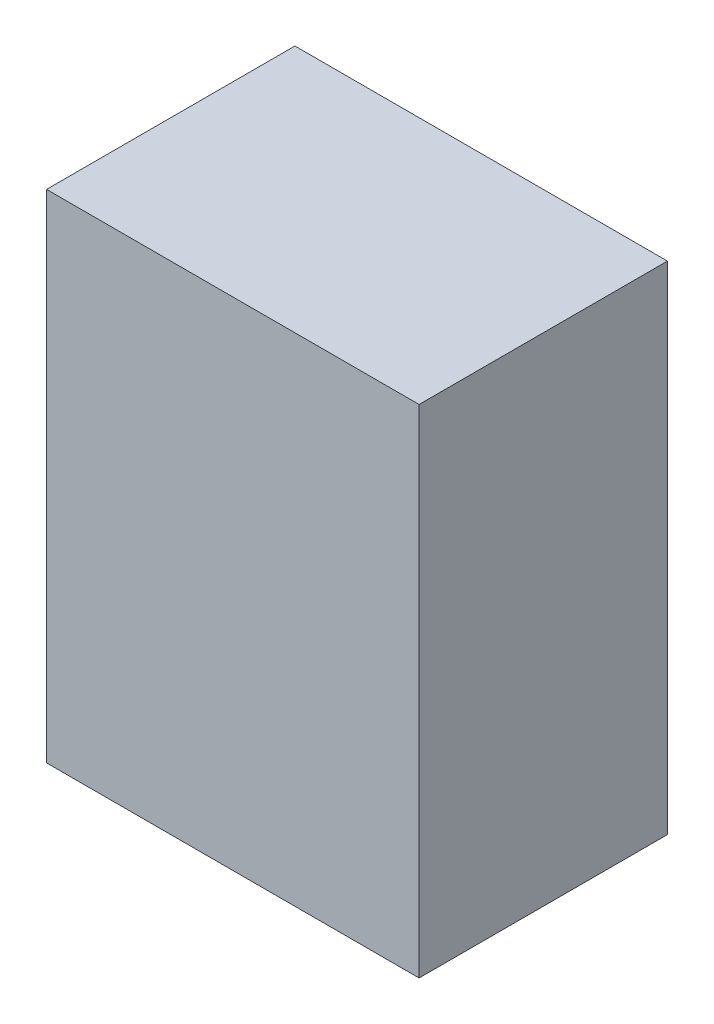
ISO-10303-21;
HEADER;
FILE_DESCRIPTION(('STEP AP214'),'2;1');
FILE_NAME('part.step','',(''),(''),'','','');
FILE_SCHEMA(('AUTOMOTIVE_DESIGN { 1 0 10303 214 1 1 1 1 }'));
ENDSEC;
DATA;
#1=APPLICATION_CONTEXT('core data for automotive mechanical design processes');
#2=APPLICATION_PROTOCOL_DEFINITION('international standard','automotive_design',2000,#1);
#3=PRODUCT_CONTEXT('',#1,'mechanical');
#4=PRODUCT('Part','Part','',(#3));
#5=PRODUCT_RELATED_PRODUCT_CATEGORY('part','',(#4));
#6=PRODUCT_DEFINITION_FORMATION('','',#4);
#7=PRODUCT_DEFINITION_CONTEXT('part definition',#1,'design');
#8=PRODUCT_DEFINITION('design','',#6,#7);
#9=PRODUCT_DEFINITION_SHAPE('','',#8);
#10=(LENGTH_UNIT() NAMED_UNIT(*) SI_UNIT(.MILLI.,.METRE.));
#11=(NAMED_UNIT(*) PLANE_ANGLE_UNIT() SI_UNIT($,.RADIAN.));
#12=(NAMED_UNIT(*) SI_UNIT($,.STERADIAN.) SOLID_ANGLE_UNIT());
#13=UNCERTAINTY_MEASURE_WITH_UNIT(LENGTH_MEASURE(1.E-05),#10,'distance_accuracy_value','');
#14=(GEOMETRIC_REPRESENTATION_CONTEXT(3) GLOBAL_UNCERTAINTY_ASSIGNED_CONTEXT((#13)) GLOBAL_UNIT_ASSIGNED_CONTEXT((#10,
#11,#12)) REPRESENTATION_CONTEXT('',''));
#15=CARTESIAN_POINT('',(0.,0.,0.));
#16=DIRECTION('',(0.,0.,1.));
#17=DIRECTION('',(1.,0.,0.));
#18=AXIS2_PLACEMENT_3D('',#15,#16,#17);
#19=CARTESIAN_POINT('',(2.38124999999999,6.35,-1.58750000000001));
#20=DIRECTION('',(-1.,0.,0.));
#21=DIRECTION('',(0.,0.,1.));
#22=AXIS2_PLACEMENT_3D('',#19,#20,#21);
#23=PLANE('',#22);
#24=DIRECTION('',(0.,0.,-1.));
#25=VECTOR('',#24,1.);
#26=CARTESIAN_POINT('',(2.38124999999999,0.,-1.58750000000001));
#27=LINE('',#26,#25);
#28=CARTESIAN_POINT('',(2.38124999999999,0.,1.58750000000001));
#29=VERTEX_POINT('',#28);
#30=CARTESIAN_POINT('',(2.38124999999999,0.,-1.58750000000001));
#31=VERTEX_POINT('',#30);
#32=EDGE_CURVE('E110',#29,#31,#27,.T.);
#33=ORIENTED_EDGE('',*,*,#32,.T.);
#34=DIRECTION('',(0.,-1.,0.));
#35=VECTOR('',#34,1.);
#36=CARTESIAN_POINT('',(2.38124999999999,6.35,-1.58750000000001));
#37=LINE('',#36,#35);
#38=CARTESIAN_POINT('',(2.38124999999999,6.35,-1.58750000000001));
#39=VERTEX_POINT('',#38);
#40=EDGE_CURVE('E11',#39,#31,#37,.T.);
#41=ORIENTED_EDGE('',*,*,#40,.F.);
#42=DIRECTION('',(0.,0.,-1.));
#43=VECTOR('',#42,1.);
#44=CARTESIAN_POINT('',(2.38124999999999,6.35,-1.58750000000001));
#45=LINE('',#44,#43);
#46=CARTESIAN_POINT('',(2.38124999999999,6.35,1.58750000000001));
#47=VERTEX_POINT('',#46);
#48=EDGE_CURVE('E92',#47,#39,#45,.T.);
#49=ORIENTED_EDGE('',*,*,#48,.F.);
#50=DIRECTION('',(0.,-1.,0.));
#51=VECTOR('',#50,1.);
#52=CARTESIAN_POINT('',(2.38124999999999,6.35,1.58750000000001));
#53=LINE('',#52,#51);
#54=EDGE_CURVE('E106',#47,#29,#53,.T.);
#55=ORIENTED_EDGE('',*,*,#54,.T.);
#56=EDGE_LOOP('',(#33,#41,#49,#55));
#57=FACE_BOUND('',#56,.T.);
#58=ADVANCED_FACE('F40',(#57),#23,.F.);
#59=CARTESIAN_POINT('',(-2.38125000000002,6.35,-1.58749999999999));
#60=DIRECTION('',(0.,0.,1.));
#61=DIRECTION('',(1.,0.,0.));
#62=AXIS2_PLACEMENT_3D('',#59,#60,#61);
#63=PLANE('',#62);
#64=DIRECTION('',(-1.,0.,0.));
#65=VECTOR('',#64,1.);
#66=CARTESIAN_POINT('',(-2.38125000000002,0.,-1.58750000000001));
#67=LINE('',#66,#65);
#68=CARTESIAN_POINT('',(-2.38125000000002,0.,-1.58750000000001));
#69=VERTEX_POINT('',#68);
#70=EDGE_CURVE('E97',#31,#69,#67,.T.);
#71=ORIENTED_EDGE('',*,*,#70,.T.);
#72=DIRECTION('',(0.,-1.,0.));
#73=VECTOR('',#72,1.);
#74=CARTESIAN_POINT('',(-2.38125000000002,6.35,-1.58749999999999));
#75=LINE('',#74,#73);
#76=CARTESIAN_POINT('',(-2.38125000000002,6.35,-1.58749999999999));
#77=VERTEX_POINT('',#76);
#78=EDGE_CURVE('E49',#77,#69,#75,.T.);
#79=ORIENTED_EDGE('',*,*,#78,.F.);
#80=DIRECTION('',(-1.,0.,0.));
#81=VECTOR('',#80,1.);
#82=CARTESIAN_POINT('',(-2.38125000000002,6.35,-1.58749999999999));
#83=LINE('',#82,#81);
#84=EDGE_CURVE('E87',#39,#77,#83,.T.);
#85=ORIENTED_EDGE('',*,*,#84,.F.);
#86=ORIENTED_EDGE('',*,*,#40,.T.);
#87=EDGE_LOOP('',(#71,#79,#85,#86));
#88=FACE_BOUND('',#87,.T.);
#89=ADVANCED_FACE('F96',(#88),#63,.F.);
#90=CARTESIAN_POINT('',(-2.38125000000002,6.35,-1.58749999999999));
#91=DIRECTION('',(1.,0.,0.));
#92=DIRECTION('',(0.,0.,-1.));
#93=AXIS2_PLACEMENT_3D('',#90,#91,#92);
#94=PLANE('',#93);
#95=DIRECTION('',(0.,0.,1.));
#96=VECTOR('',#95,1.);
#97=CARTESIAN_POINT('',(-2.38125000000002,0.,-1.58750000000001));
#98=LINE('',#97,#96);
#99=CARTESIAN_POINT('',(-2.38125000000002,0.,1.58750000000001));
#100=VERTEX_POINT('',#99);
#101=EDGE_CURVE('E74',#69,#100,#98,.T.);
#102=ORIENTED_EDGE('',*,*,#101,.T.);
#103=DIRECTION('',(0.,-1.,0.));
#104=VECTOR('',#103,1.);
#105=CARTESIAN_POINT('',(-2.38125000000002,6.35,1.58750000000002));
#106=LINE('',#105,#104);
#107=CARTESIAN_POINT('',(-2.38125000000002,6.35,1.58750000000002));
#108=VERTEX_POINT('',#107);
#109=EDGE_CURVE('E99',#108,#100,#106,.T.);
#110=ORIENTED_EDGE('',*,*,#109,.F.);
#111=DIRECTION('',(0.,0.,1.));
#112=VECTOR('',#111,1.);
#113=CARTESIAN_POINT('',(-2.38125000000002,6.35,-1.58749999999999));
#114=LINE('',#113,#112);
#115=EDGE_CURVE('E90',#77,#108,#114,.T.);
#116=ORIENTED_EDGE('',*,*,#115,.F.);
#117=ORIENTED_EDGE('',*,*,#78,.T.);
#118=EDGE_LOOP('',(#102,#110,#116,#117));
#119=FACE_BOUND('',#118,.T.);
#120=ADVANCED_FACE('F100',(#119),#94,.F.);
#121=CARTESIAN_POINT('',(-2.38125000000002,6.35,1.58750000000002));
#122=DIRECTION('',(0.,0.,-1.));
#123=DIRECTION('',(-1.,0.,0.));
#124=AXIS2_PLACEMENT_3D('',#121,#122,#123);
#125=PLANE('',#124);
#126=DIRECTION('',(1.,0.,0.));
#127=VECTOR('',#126,1.);
#128=CARTESIAN_POINT('',(-2.38125000000002,0.,1.58750000000001));
#129=LINE('',#128,#127);
#130=EDGE_CURVE('E80',#100,#29,#129,.T.);
#131=ORIENTED_EDGE('',*,*,#130,.T.);
#132=ORIENTED_EDGE('',*,*,#54,.F.);
#133=DIRECTION('',(1.,0.,0.));
#134=VECTOR('',#133,1.);
#135=CARTESIAN_POINT('',(-2.38125000000002,6.35,1.58750000000002));
#136=LINE('',#135,#134);
#137=EDGE_CURVE('E57',#108,#47,#136,.T.);
#138=ORIENTED_EDGE('',*,*,#137,.F.);
#139=ORIENTED_EDGE('',*,*,#109,.T.);
#140=EDGE_LOOP('',(#131,#132,#138,#139));
#141=FACE_BOUND('',#140,.T.);
#142=ADVANCED_FACE('F125',(#141),#125,.F.);
#143=CARTESIAN_POINT('',(0.,6.34999999999999,0.));
#144=DIRECTION('',(0.,1.,0.));
#145=DIRECTION('',(0.,0.,1.));
#146=AXIS2_PLACEMENT_3D('',#143,#144,#145);
#147=PLANE('',#146);
#148=ORIENTED_EDGE('',*,*,#48,.T.);
#149=ORIENTED_EDGE('',*,*,#84,.T.);
#150=ORIENTED_EDGE('',*,*,#115,.T.);
#151=ORIENTED_EDGE('',*,*,#137,.T.);
#152=EDGE_LOOP('',(#148,#149,#150,#151));
#153=FACE_BOUND('',#152,.T.);
#154=ADVANCED_FACE('F88',(#153),#147,.T.);
#155=CARTESIAN_POINT('',(0.,0.,0.));
#156=DIRECTION('',(0.,1.,0.));
#157=DIRECTION('',(0.,0.,1.));
#158=AXIS2_PLACEMENT_3D('',#155,#156,#157);
#159=PLANE('',#158);
#160=ORIENTED_EDGE('',*,*,#32,.F.);
#161=ORIENTED_EDGE('',*,*,#130,.F.);
#162=ORIENTED_EDGE('',*,*,#101,.F.);
#163=ORIENTED_EDGE('',*,*,#70,.F.);
#164=EDGE_LOOP('',(#160,#161,#162,#163));
#165=FACE_BOUND('',#164,.T.);
#166=ADVANCED_FACE('F128',(#165),#159,.F.);
#167=CLOSED_SHELL('',(#58,#89,#120,#142,#154,#166));
#168=MANIFOLD_SOLID_BREP('B2',#167);
#169=ADVANCED_BREP_SHAPE_REPRESENTATION('',(#18,#168),#14);
#170=SHAPE_DEFINITION_REPRESENTATION(#9,#169);
ENDSEC;
END-ISO-10303-21;
